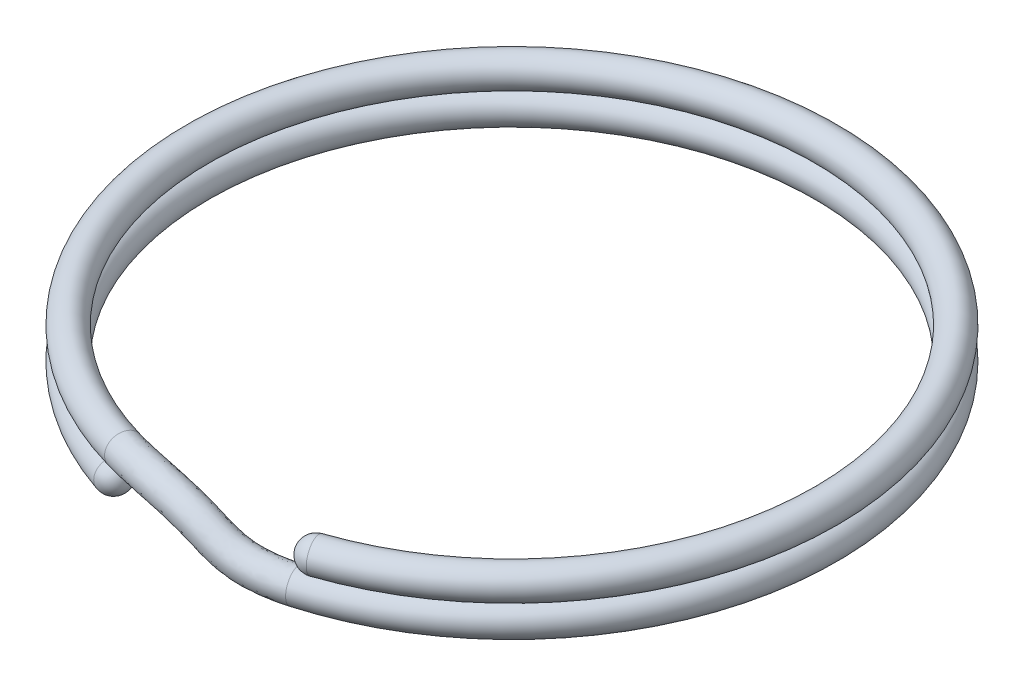
ISO-10303-21;
HEADER;
FILE_DESCRIPTION(('STEP AP214'),'2;1');
FILE_NAME('part.step','',(''),(''),'','','');
FILE_SCHEMA(('AUTOMOTIVE_DESIGN { 1 0 10303 214 1 1 1 1 }'));
ENDSEC;
DATA;
#1=APPLICATION_CONTEXT('core data for automotive mechanical design processes');
#2=APPLICATION_PROTOCOL_DEFINITION('international standard','automotive_design',2000,#1);
#3=PRODUCT_CONTEXT('',#1,'mechanical');
#4=PRODUCT('Part','Part','',(#3));
#5=PRODUCT_RELATED_PRODUCT_CATEGORY('part','',(#4));
#6=PRODUCT_DEFINITION_FORMATION('','',#4);
#7=PRODUCT_DEFINITION_CONTEXT('part definition',#1,'design');
#8=PRODUCT_DEFINITION('design','',#6,#7);
#9=PRODUCT_DEFINITION_SHAPE('','',#8);
#10=(LENGTH_UNIT() NAMED_UNIT(*) SI_UNIT(.MILLI.,.METRE.));
#11=(NAMED_UNIT(*) PLANE_ANGLE_UNIT() SI_UNIT($,.RADIAN.));
#12=(NAMED_UNIT(*) SI_UNIT($,.STERADIAN.) SOLID_ANGLE_UNIT());
#13=UNCERTAINTY_MEASURE_WITH_UNIT(LENGTH_MEASURE(1.E-05),#10,'distance_accuracy_value','');
#14=(GEOMETRIC_REPRESENTATION_CONTEXT(3) GLOBAL_UNCERTAINTY_ASSIGNED_CONTEXT((#13)) GLOBAL_UNIT_ASSIGNED_CONTEXT((#10,
#11,#12)) REPRESENTATION_CONTEXT('',''));
#15=CARTESIAN_POINT('',(0.,0.,0.));
#16=DIRECTION('',(0.,0.,1.));
#17=DIRECTION('',(1.,0.,0.));
#18=AXIS2_PLACEMENT_3D('',#15,#16,#17);
#19=CARTESIAN_POINT('',(0.,1.02197470450919,0.));
#20=DIRECTION('',(0.,1.,0.));
#21=DIRECTION('',(0.,0.,1.));
#22=AXIS2_PLACEMENT_3D('',#19,#20,#21);
#23=TOROIDAL_SURFACE('',#22,5.,0.25);
#24=CARTESIAN_POINT('',(1.61226854487482,1.02197470450919,4.73292617090181));
#25=DIRECTION('',(0.946585234180361,0.,-0.322453708974964));
#26=DIRECTION('',(-0.322453708974964,0.,-0.946585234180361));
#27=AXIS2_PLACEMENT_3D('',#24,#25,#26);
#28=CIRCLE('',#27,0.25);
#29=CARTESIAN_POINT('',(1.69288197211856,1.02197470450919,4.9695724794469));
#30=VERTEX_POINT('',#29);
#31=EDGE_CURVE('E47',#30,#30,#28,.T.);
#32=CARTESIAN_POINT('',(-1.37360563948689,1.02197470450919,4.80761973820412));
#33=DIRECTION('',(0.961523947640823,0.,0.274721127897378));
#34=DIRECTION('',(0.274721127897378,0.,-0.961523947640823));
#35=AXIS2_PLACEMENT_3D('',#32,#33,#34);
#36=CIRCLE('',#35,0.25);
#37=CARTESIAN_POINT('',(-1.44228592146123,1.02197470450919,5.04800072511432));
#38=VERTEX_POINT('',#37);
#39=EDGE_CURVE('E102',#38,#38,#36,.F.);
#40=CARTESIAN_POINT('',(0.,1.02197470450919,0.));
#41=DIRECTION('',(0.,1.,0.));
#42=DIRECTION('',(0.,0.,1.));
#43=AXIS2_PLACEMENT_3D('',#40,#41,#42);
#44=CIRCLE('',#43,5.25);
#45=EDGE_CURVE('',#30,#38,#44,.T.);
#46=ORIENTED_EDGE('',*,*,#31,.T.);
#47=ORIENTED_EDGE('',*,*,#39,.T.);
#48=ORIENTED_EDGE('',*,*,#45,.T.);
#49=ORIENTED_EDGE('',*,*,#45,.F.);
#50=EDGE_LOOP('',(#46,#48,#47,#49));
#51=FACE_BOUND('',#50,.T.);
#52=ADVANCED_FACE('F91',(#51),#23,.T.);
#53=CARTESIAN_POINT('',(1.30523929024365,0.545750641302031,4.56833751585274));
#54=CARTESIAN_POINT('',(1.19499197956864,0.545750620947194,4.5998367461877));
#55=CARTESIAN_POINT('',(1.08356870075468,0.547511426719057,4.62724060813213));
#56=CARTESIAN_POINT('',(0.860829966506423,0.562855843512958,4.67372210825403));
#57=CARTESIAN_POINT('',(0.749318834018425,0.576359853753287,4.69281950209857));
#58=CARTESIAN_POINT('',(0.529221588559903,0.622843187932349,4.72250774222021));
#59=CARTESIAN_POINT('',(0.425144672423402,0.664505687326749,4.73302662279305));
#60=CARTESIAN_POINT('',(0.217971365221759,0.758104352476063,4.74680391600613));
#61=CARTESIAN_POINT('',(0.114853102682621,0.810347934165325,4.75002291395165));
#62=CARTESIAN_POINT('',(-0.414281357048374,1.02335693614538,4.75065530588866));
#63=CARTESIAN_POINT('',(-0.873129588888239,1.02197476238104,4.69060896426955));
#64=CARTESIAN_POINT('',(-1.30492535751255,1.02197470450919,4.56723875129391));
#65=CARTESIAN_POINT('',(1.31835773881431,1.04346517652183,4.6142520858501));
#66=CARTESIAN_POINT('',(1.21218759958239,1.04346515888338,4.64458640504437));
#67=CARTESIAN_POINT('',(1.11039390158368,1.04528483130931,4.66916105029885));
#68=CARTESIAN_POINT('',(0.918838609027997,1.05848219022551,4.70900369413008));
#69=CARTESIAN_POINT('',(0.815494421070064,1.07262491662305,4.72589413535992));
#70=CARTESIAN_POINT('',(0.676379064604414,1.10199534682129,4.74466215644789));
#71=CARTESIAN_POINT('',(0.618907965322106,1.12530584953544,4.75084069597889));
#72=CARTESIAN_POINT('',(0.437364031354546,1.20732856764698,4.7630160987357));
#73=CARTESIAN_POINT('',(0.329682227566061,1.26253063919673,4.76747021249956));
#74=CARTESIAN_POINT('',(-0.340468621664347,1.53230363986677,4.76827736037946));
#75=CARTESIAN_POINT('',(-0.8730376727217,1.52197476244027,4.6906352449441));
#76=CARTESIAN_POINT('',(-1.30492535751255,1.52197470450919,4.56723875129391));
#77=CARTESIAN_POINT('',(1.45509043730081,0.99571330293614,5.09281653055285));
#78=CARTESIAN_POINT('',(1.33660101946356,0.995713283521694,5.12667064370418));
#79=CARTESIAN_POINT('',(1.22215474000979,0.997966240533553,5.15439410868158));
#80=CARTESIAN_POINT('',(1.00435621131253,1.01310734882474,5.19972613906813));
#81=CARTESIAN_POINT('',(0.887797378978256,1.02889451502838,5.21891818291807));
#82=CARTESIAN_POINT('',(0.720389694479609,1.06423980511147,5.24150233712548));
#83=CARTESIAN_POINT('',(0.649875619405719,1.09267811756931,5.24894456963454));
#84=CARTESIAN_POINT('',(0.447462210346295,1.18401185067543,5.2625012266167));
#85=CARTESIAN_POINT('',(0.331981721849685,1.24276115892972,5.2671543856556));
#86=CARTESIAN_POINT('',(-0.379720828543048,1.52925197863425,5.26801049446637));
#87=CARTESIAN_POINT('',(-0.961321693725626,1.52197476300259,5.18541908503965));
#88=CARTESIAN_POINT('',(-1.44228592146124,1.52197470450919,5.04800072511432));
#89=CARTESIAN_POINT('',(1.44197198873015,0.497998767716344,5.04690196055549));
#90=CARTESIAN_POINT('',(1.31940539944981,0.497998745585521,5.0819209848474));
#91=CARTESIAN_POINT('',(1.1953295391808,0.500192835943317,5.11247366651484));
#92=CARTESIAN_POINT('',(0.946347568790959,0.517481002112183,5.16444455319211));
#93=CARTESIAN_POINT('',(0.821621791926617,0.532629452158605,5.18584354965674));
#94=CARTESIAN_POINT('',(0.573232218435099,0.585087646222533,5.21934792289778));
#95=CARTESIAN_POINT('',(0.456112326507014,0.631877955360622,5.23113049644869));
#96=CARTESIAN_POINT('',(0.228069544213507,0.734787635504503,5.24628904388714));
#97=CARTESIAN_POINT('',(0.117152596966248,0.790578453898322,5.24970708710764));
#98=CARTESIAN_POINT('',(-0.453533563927088,1.02030527491286,5.25038843997578));
#99=CARTESIAN_POINT('',(-0.961413609892165,1.0219747629433,5.1853928043651));
#100=CARTESIAN_POINT('',(-1.44228592146124,1.02197470450919,5.04800072511432));
#101=CARTESIAN_POINT('',(1.42885354015948,0.000284232496548407,5.00098739055814));
#102=CARTESIAN_POINT('',(1.30220977943605,0.000284207649348043,5.03717132599061));
#103=CARTESIAN_POINT('',(1.1685043383518,0.00241943135308126,5.0705532243481));
#104=CARTESIAN_POINT('',(0.888338926269386,0.0218546553996218,5.12916296731608));
#105=CARTESIAN_POINT('',(0.755446204874978,0.0363643892888337,5.15276891639542));
#106=CARTESIAN_POINT('',(0.426074742390588,0.1059354873336,5.19719350867007));
#107=CARTESIAN_POINT('',(0.262349033608309,0.171077793151939,5.21331642326285));
#108=CARTESIAN_POINT('',(0.00867687808072008,0.285563420333575,5.23007686115757));
#109=CARTESIAN_POINT('',(-0.0976765279171897,0.338395748866921,5.23225978855968));
#110=CARTESIAN_POINT('',(-0.527346299311129,0.511358571191463,5.23276638548519));
#111=CARTESIAN_POINT('',(-0.961505526058703,0.521974762884007,5.18536652369055));
#112=CARTESIAN_POINT('',(-1.44228592146124,0.521974704509188,5.04800072511432));
#113=CARTESIAN_POINT('',(1.29212084167298,0.0480361060822352,4.52242294585538));
#114=CARTESIAN_POINT('',(1.17779635955488,0.0480360830110051,4.55508708733102));
#115=CARTESIAN_POINT('',(1.05674349992569,0.0497380221288082,4.58532016596542));
#116=CARTESIAN_POINT('',(0.80282132398485,0.0672294968004101,4.63844052237798));
#117=CARTESIAN_POINT('',(0.683143246966786,0.0800947908835253,4.65974486883722));
#118=CARTESIAN_POINT('',(0.382064112515392,0.143691029043405,4.70035332799252));
#119=CARTESIAN_POINT('',(0.231381379524697,0.203705525118052,4.7152125496072));
#120=CARTESIAN_POINT('',(-0.00142130091102861,0.308880137305148,4.73059173327657));
#121=CARTESIAN_POINT('',(-0.0999760222008198,0.358165229133922,4.73257561540374));
#122=CARTESIAN_POINT('',(-0.488094092432402,0.514410232424003,4.73303325139787));
#123=CARTESIAN_POINT('',(-0.873221505054778,0.521974762321815,4.69058268359499));
#124=CARTESIAN_POINT('',(-1.30492535751255,0.521974704509188,4.56723875129391));
#125=CARTESIAN_POINT('',(1.30523929024365,0.545750641302031,4.56833751585274));
#126=CARTESIAN_POINT('',(1.19499197956864,0.545750620947194,4.5998367461877));
#127=CARTESIAN_POINT('',(1.08356870075468,0.547511426719057,4.62724060813213));
#128=CARTESIAN_POINT('',(0.860829966506423,0.562855843512958,4.67372210825403));
#129=CARTESIAN_POINT('',(0.749318834018425,0.576359853753287,4.69281950209857));
#130=CARTESIAN_POINT('',(0.529221588559903,0.622843187932349,4.72250774222021));
#131=CARTESIAN_POINT('',(0.425144672423402,0.664505687326749,4.73302662279305));
#132=CARTESIAN_POINT('',(0.217971365221759,0.758104352476063,4.74680391600613));
#133=CARTESIAN_POINT('',(0.114853102682621,0.810347934165325,4.75002291395165));
#134=CARTESIAN_POINT('',(-0.414281357048374,1.02335693614538,4.75065530588866));
#135=CARTESIAN_POINT('',(-0.873129588888239,1.02197476238104,4.69060896426955));
#136=CARTESIAN_POINT('',(-1.30492535751255,1.02197470450919,4.56723875129391));
#137=(BOUNDED_SURFACE() B_SPLINE_SURFACE(3,3,((#53,#54,#55,#56,#57,#58,#59,#60,#61,#62,#63,#64),
(#65,#66,#67,#68,#69,#70,#71,#72,#73,#74,#75,#76),(#77,#78,#79,#80,#81,#82,#83,#84,#85,#86,#87,
#88),(#89,#90,#91,#92,#93,#94,#95,#96,#97,#98,#99,#100),(#101,#102,#103,#104,#105,#106,#107,
#108,#109,#110,#111,#112),(#113,#114,#115,#116,#117,#118,#119,#120,#121,#122,#123,#124),(#125,
#126,#127,#128,#129,#130,#131,#132,#133,#134,#135,#136)),.UNSPECIFIED.,.T.,.F.,
.F.) B_SPLINE_SURFACE_WITH_KNOTS((4,3,4),(4,2,2,2,2,4),(0.,0.5,1.),(0.,0.125,0.25,0.375,0.5,1.),
.UNSPECIFIED.) GEOMETRIC_REPRESENTATION_ITEM() RATIONAL_B_SPLINE_SURFACE(((1.,1.,1.,1.,1.,1.,1.,
1.,1.,1.,1.,1.),(0.333333333333333,0.333333333333333,0.333333333333333,0.333333333333333,
0.333333333333333,0.333333333333333,0.333333333333333,0.333333333333333,0.333333333333333,
0.333333333333333,0.333333333333333,0.333333333333333),(0.333333333333333,0.333333333333333,
0.333333333333333,0.333333333333333,0.333333333333333,0.333333333333333,0.333333333333333,
0.333333333333333,0.333333333333333,0.333333333333333,0.333333333333333,0.333333333333333),(1.,
1.,1.,1.,1.,1.,1.,1.,1.,1.,1.,1.),(0.333333333333333,0.333333333333333,0.333333333333333,
0.333333333333333,0.333333333333333,0.333333333333333,0.333333333333333,0.333333333333333,
0.333333333333333,0.333333333333333,0.333333333333333,0.333333333333333),(0.333333333333333,
0.333333333333333,0.333333333333333,0.333333333333333,0.333333333333333,0.333333333333333,
0.333333333333333,0.333333333333333,0.333333333333333,0.333333333333333,0.333333333333333,
0.333333333333333),(1.,1.,1.,1.,1.,1.,1.,1.,1.,1.,1.,1.))) REPRESENTATION_ITEM('') SURFACE());
#138=CARTESIAN_POINT('',(1.3736056394869,0.521874704509188,4.80761973820412));
#139=DIRECTION('',(0.961523947640824,0.,-0.274721127897374));
#140=DIRECTION('',(-0.273465396973001,0.0955037471713734,-0.957128889405511));
#141=AXIS2_PLACEMENT_3D('',#138,#139,#140);
#142=CIRCLE('',#141,0.25);
#143=CARTESIAN_POINT('',(1.44228592146124,0.521874704509188,5.04800072511432));
#144=VERTEX_POINT('',#143);
#145=EDGE_CURVE('E106',#144,#144,#142,.T.);
#146=ORIENTED_EDGE('',*,*,#39,.F.);
#147=EDGE_LOOP('',(#146));
#148=FACE_BOUND('',#147,.T.);
#149=ORIENTED_EDGE('',*,*,#145,.F.);
#150=EDGE_LOOP('',(#149));
#151=FACE_BOUND('',#150,.T.);
#152=ADVANCED_FACE('F114',(#148,#151),#137,.F.);
#153=CARTESIAN_POINT('',(0.,0.521874704509188,0.));
#154=DIRECTION('',(0.,1.,0.));
#155=DIRECTION('',(0.,0.,1.));
#156=AXIS2_PLACEMENT_3D('',#153,#154,#155);
#157=TOROIDAL_SURFACE('',#156,5.,0.25);
#158=CARTESIAN_POINT('',(-1.61226854487482,0.521874704509188,4.73292617090181));
#159=DIRECTION('',(0.946585234180361,0.,0.322453708974964));
#160=DIRECTION('',(0.322453708974964,0.,-0.946585234180361));
#161=AXIS2_PLACEMENT_3D('',#158,#159,#160);
#162=CIRCLE('',#161,0.25);
#163=CARTESIAN_POINT('',(-1.69288197211856,0.521874704509188,4.9695724794469));
#164=VERTEX_POINT('',#163);
#165=EDGE_CURVE('E98',#164,#164,#162,.F.);
#166=CARTESIAN_POINT('',(0.,0.521874704509188,0.));
#167=DIRECTION('',(0.,1.,0.));
#168=DIRECTION('',(0.,0.,1.));
#169=AXIS2_PLACEMENT_3D('',#166,#167,#168);
#170=CIRCLE('',#169,5.25);
#171=EDGE_CURVE('',#144,#164,#170,.T.);
#172=ORIENTED_EDGE('',*,*,#145,.T.);
#173=ORIENTED_EDGE('',*,*,#165,.T.);
#174=ORIENTED_EDGE('',*,*,#171,.T.);
#175=ORIENTED_EDGE('',*,*,#171,.F.);
#176=EDGE_LOOP('',(#172,#174,#173,#175));
#177=FACE_BOUND('',#176,.T.);
#178=ADVANCED_FACE('F112',(#177),#157,.T.);
#179=CARTESIAN_POINT('',(-1.61226854487482,0.521874704509188,4.73292617090181));
#180=DIRECTION('',(0.961523947640823,0.,0.274721127897378));
#181=DIRECTION('',(0.274721127897378,0.,-0.961523947640823));
#182=AXIS2_PLACEMENT_3D('',#179,#180,#181);
#183=SPHERICAL_SURFACE('',#182,0.25);
#184=CARTESIAN_POINT('',(-1.61226854487482,0.521874704509188,4.73292617090181));
#185=DIRECTION('',(0.946585234180361,0.,0.322453708974964));
#186=DIRECTION('',(0.322453708974964,0.,-0.946585234180361));
#187=AXIS2_PLACEMENT_3D('',#184,#185,#186);
#188=SPHERICAL_SURFACE('',#187,0.25);
#189=ORIENTED_EDGE('',*,*,#165,.F.);
#190=EDGE_LOOP('',(#189));
#191=FACE_BOUND('',#190,.T.);
#192=ADVANCED_FACE('F122',(#191),#188,.T.);
#193=CARTESIAN_POINT('',(1.61226854487482,1.02197470450919,4.73292617090181));
#194=DIRECTION('',(-0.961523947640823,0.,0.274721127897378));
#195=DIRECTION('',(0.274721127897378,0.,0.961523947640823));
#196=AXIS2_PLACEMENT_3D('',#193,#194,#195);
#197=SPHERICAL_SURFACE('',#196,0.25);
#198=CARTESIAN_POINT('',(1.61226854487482,1.02197470450919,4.73292617090181));
#199=DIRECTION('',(0.946585234180361,0.,-0.322453708974964));
#200=DIRECTION('',(-0.322453708974964,0.,-0.946585234180361));
#201=AXIS2_PLACEMENT_3D('',#198,#199,#200);
#202=SPHERICAL_SURFACE('',#201,0.25);
#203=ORIENTED_EDGE('',*,*,#31,.F.);
#204=EDGE_LOOP('',(#203));
#205=FACE_BOUND('',#204,.T.);
#206=ADVANCED_FACE('F93',(#205),#202,.T.);
#207=CLOSED_SHELL('',(#52,#152,#178,#192,#206));
#208=MANIFOLD_SOLID_BREP('B6',#207);
#209=ADVANCED_BREP_SHAPE_REPRESENTATION('',(#18,#208),#14);
#210=SHAPE_DEFINITION_REPRESENTATION(#9,#209);
ENDSEC;
END-ISO-10303-21;
